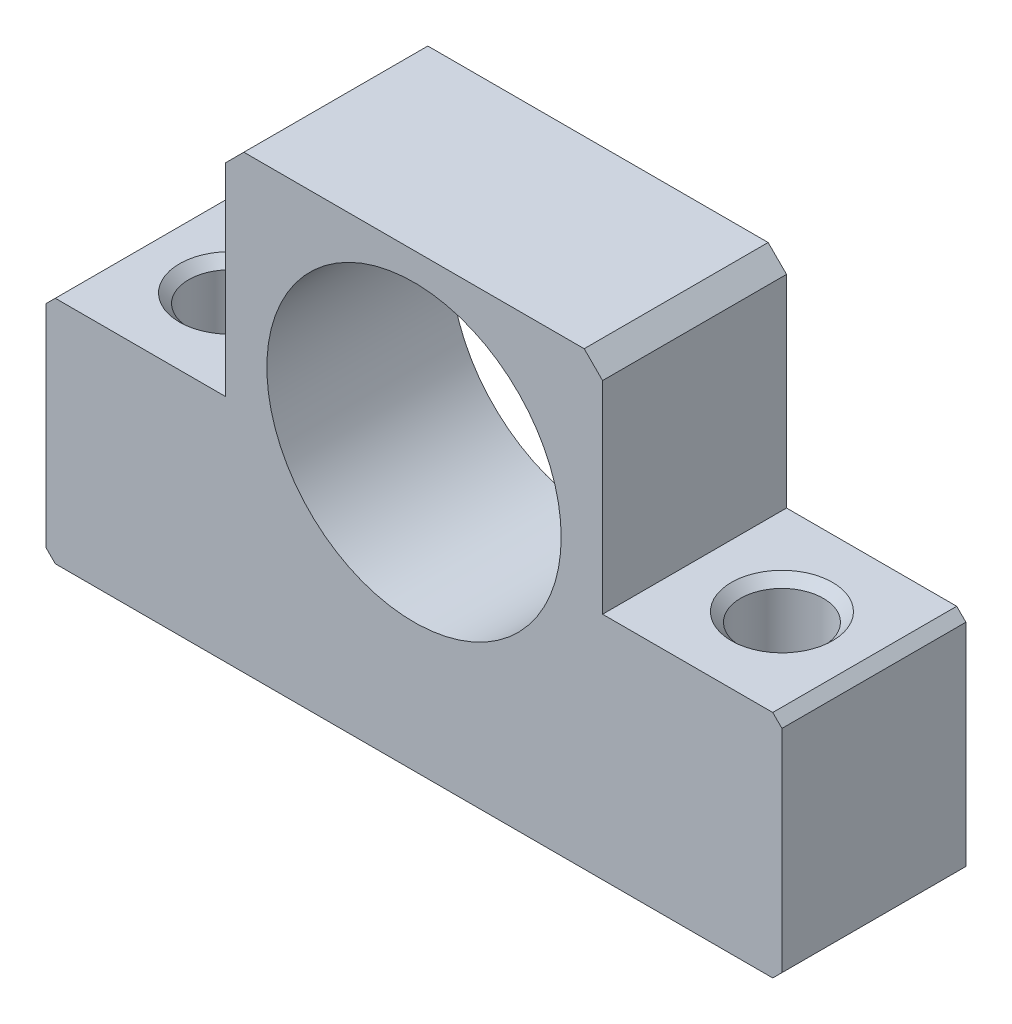
ISO-10303-21;
HEADER;
FILE_DESCRIPTION(('STEP AP214'),'2;1');
FILE_NAME('part.step','',(''),(''),'','','');
FILE_SCHEMA(('AUTOMOTIVE_DESIGN { 1 0 10303 214 1 1 1 1 }'));
ENDSEC;
DATA;
#1=APPLICATION_CONTEXT('core data for automotive mechanical design processes');
#2=APPLICATION_PROTOCOL_DEFINITION('international standard','automotive_design',2000,#1);
#3=PRODUCT_CONTEXT('',#1,'mechanical');
#4=PRODUCT('Part','Part','',(#3));
#5=PRODUCT_RELATED_PRODUCT_CATEGORY('part','',(#4));
#6=PRODUCT_DEFINITION_FORMATION('','',#4);
#7=PRODUCT_DEFINITION_CONTEXT('part definition',#1,'design');
#8=PRODUCT_DEFINITION('design','',#6,#7);
#9=PRODUCT_DEFINITION_SHAPE('','',#8);
#10=(LENGTH_UNIT() NAMED_UNIT(*) SI_UNIT(.MILLI.,.METRE.));
#11=(NAMED_UNIT(*) PLANE_ANGLE_UNIT() SI_UNIT($,.RADIAN.));
#12=(NAMED_UNIT(*) SI_UNIT($,.STERADIAN.) SOLID_ANGLE_UNIT());
#13=UNCERTAINTY_MEASURE_WITH_UNIT(LENGTH_MEASURE(1.E-05),#10,'distance_accuracy_value','');
#14=(GEOMETRIC_REPRESENTATION_CONTEXT(3) GLOBAL_UNCERTAINTY_ASSIGNED_CONTEXT((#13)) GLOBAL_UNIT_ASSIGNED_CONTEXT((#10,
#11,#12)) REPRESENTATION_CONTEXT('',''));
#15=CARTESIAN_POINT('',(0.,0.,0.));
#16=DIRECTION('',(0.,0.,1.));
#17=DIRECTION('',(1.,0.,0.));
#18=AXIS2_PLACEMENT_3D('',#15,#16,#17);
#19=CARTESIAN_POINT('',(-39.,-30.,-20.));
#20=DIRECTION('',(0.,-1.,0.));
#21=DIRECTION('',(0.,0.,-1.));
#22=AXIS2_PLACEMENT_3D('',#19,#20,#21);
#23=PLANE('',#22);
#24=CARTESIAN_POINT('',(30.,-30.,-10.));
#25=DIRECTION('',(0.,1.,0.));
#26=DIRECTION('',(0.,0.,1.));
#27=AXIS2_PLACEMENT_3D('',#24,#25,#26);
#28=CIRCLE('',#27,5.5);
#29=CARTESIAN_POINT('',(30.,-30.,-4.5));
#30=VERTEX_POINT('',#29);
#31=EDGE_CURVE('E471',#30,#30,#28,.T.);
#32=ORIENTED_EDGE('',*,*,#31,.T.);
#33=EDGE_LOOP('',(#32));
#34=FACE_BOUND('',#33,.T.);
#35=DIRECTION('',(1.,0.,0.));
#36=VECTOR('',#35,1.);
#37=CARTESIAN_POINT('',(-39.,-30.,0.));
#38=LINE('',#37,#36);
#39=CARTESIAN_POINT('',(-39.,-30.,0.));
#40=VERTEX_POINT('',#39);
#41=CARTESIAN_POINT('',(39.,-30.,0.));
#42=VERTEX_POINT('',#41);
#43=EDGE_CURVE('E176',#40,#42,#38,.T.);
#44=ORIENTED_EDGE('',*,*,#43,.F.);
#45=DIRECTION('',(0.,0.,1.));
#46=VECTOR('',#45,1.);
#47=CARTESIAN_POINT('',(-39.,-30.,-20.));
#48=LINE('',#47,#46);
#49=CARTESIAN_POINT('',(-39.,-30.,-20.));
#50=VERTEX_POINT('',#49);
#51=EDGE_CURVE('E227',#50,#40,#48,.T.);
#52=ORIENTED_EDGE('',*,*,#51,.F.);
#53=DIRECTION('',(1.,0.,0.));
#54=VECTOR('',#53,1.);
#55=CARTESIAN_POINT('',(-39.,-30.,-20.));
#56=LINE('',#55,#54);
#57=CARTESIAN_POINT('',(39.,-30.,-20.));
#58=VERTEX_POINT('',#57);
#59=EDGE_CURVE('E276',#50,#58,#56,.T.);
#60=ORIENTED_EDGE('',*,*,#59,.T.);
#61=DIRECTION('',(0.,0.,1.));
#62=VECTOR('',#61,1.);
#63=CARTESIAN_POINT('',(39.,-30.,-20.));
#64=LINE('',#63,#62);
#65=EDGE_CURVE('E226',#58,#42,#64,.T.);
#66=ORIENTED_EDGE('',*,*,#65,.T.);
#67=EDGE_LOOP('',(#44,#52,#60,#66));
#68=FACE_BOUND('',#67,.T.);
#69=CARTESIAN_POINT('',(-30.,-30.,-10.));
#70=DIRECTION('',(0.,1.,0.));
#71=DIRECTION('',(0.,0.,1.));
#72=AXIS2_PLACEMENT_3D('',#69,#70,#71);
#73=CIRCLE('',#72,5.5);
#74=CARTESIAN_POINT('',(-30.,-30.,-4.5));
#75=VERTEX_POINT('',#74);
#76=EDGE_CURVE('E461',#75,#75,#73,.T.);
#77=ORIENTED_EDGE('',*,*,#76,.T.);
#78=EDGE_LOOP('',(#77));
#79=FACE_BOUND('',#78,.T.);
#80=ADVANCED_FACE('F34',(#34,#68,#79),#23,.T.);
#81=CARTESIAN_POINT('',(-20.5,-5.,-20.));
#82=DIRECTION('',(0.,1.,0.));
#83=DIRECTION('',(0.,0.,1.));
#84=AXIS2_PLACEMENT_3D('',#81,#82,#83);
#85=PLANE('',#84);
#86=DIRECTION('',(-1.,0.,0.));
#87=VECTOR('',#86,1.);
#88=CARTESIAN_POINT('',(-20.5,-5.,0.));
#89=LINE('',#88,#87);
#90=CARTESIAN_POINT('',(-20.5,-5.,0.));
#91=VERTEX_POINT('',#90);
#92=CARTESIAN_POINT('',(-39.,-5.,0.));
#93=VERTEX_POINT('',#92);
#94=EDGE_CURVE('E146',#91,#93,#89,.T.);
#95=ORIENTED_EDGE('',*,*,#94,.F.);
#96=DIRECTION('',(0.,0.,1.));
#97=VECTOR('',#96,1.);
#98=CARTESIAN_POINT('',(-20.5,-5.,-20.));
#99=LINE('',#98,#97);
#100=CARTESIAN_POINT('',(-20.5,-5.,-20.));
#101=VERTEX_POINT('',#100);
#102=EDGE_CURVE('E140',#101,#91,#99,.T.);
#103=ORIENTED_EDGE('',*,*,#102,.F.);
#104=DIRECTION('',(-1.,0.,0.));
#105=VECTOR('',#104,1.);
#106=CARTESIAN_POINT('',(-20.5,-5.,-20.));
#107=LINE('',#106,#105);
#108=CARTESIAN_POINT('',(-39.,-5.,-20.));
#109=VERTEX_POINT('',#108);
#110=EDGE_CURVE('E144',#101,#109,#107,.T.);
#111=ORIENTED_EDGE('',*,*,#110,.T.);
#112=DIRECTION('',(0.,0.,1.));
#113=VECTOR('',#112,1.);
#114=CARTESIAN_POINT('',(-39.,-5.,-20.));
#115=LINE('',#114,#113);
#116=EDGE_CURVE('E44',#109,#93,#115,.T.);
#117=ORIENTED_EDGE('',*,*,#116,.T.);
#118=EDGE_LOOP('',(#95,#103,#111,#117));
#119=FACE_BOUND('',#118,.T.);
#120=CARTESIAN_POINT('',(-30.,-5.,-10.));
#121=DIRECTION('',(0.,1.,0.));
#122=DIRECTION('',(0.,0.,1.));
#123=AXIS2_PLACEMENT_3D('',#120,#121,#122);
#124=CIRCLE('',#123,5.5);
#125=CARTESIAN_POINT('',(-30.,-5.,-4.5));
#126=VERTEX_POINT('',#125);
#127=EDGE_CURVE('E468',#126,#126,#124,.T.);
#128=ORIENTED_EDGE('',*,*,#127,.F.);
#129=EDGE_LOOP('',(#128));
#130=FACE_BOUND('',#129,.T.);
#131=ADVANCED_FACE('F142',(#119,#130),#85,.T.);
#132=CARTESIAN_POINT('',(39.,-5.,-20.));
#133=DIRECTION('',(0.,1.,0.));
#134=DIRECTION('',(0.,0.,1.));
#135=AXIS2_PLACEMENT_3D('',#132,#133,#134);
#136=PLANE('',#135);
#137=DIRECTION('',(-1.,0.,0.));
#138=VECTOR('',#137,1.);
#139=CARTESIAN_POINT('',(39.,-5.,0.));
#140=LINE('',#139,#138);
#141=CARTESIAN_POINT('',(39.,-5.,0.));
#142=VERTEX_POINT('',#141);
#143=CARTESIAN_POINT('',(20.5,-5.,0.));
#144=VERTEX_POINT('',#143);
#145=EDGE_CURVE('E188',#142,#144,#140,.T.);
#146=ORIENTED_EDGE('',*,*,#145,.F.);
#147=DIRECTION('',(0.,0.,1.));
#148=VECTOR('',#147,1.);
#149=CARTESIAN_POINT('',(39.,-5.,-20.));
#150=LINE('',#149,#148);
#151=CARTESIAN_POINT('',(39.,-5.,-20.));
#152=VERTEX_POINT('',#151);
#153=EDGE_CURVE('E220',#152,#142,#150,.T.);
#154=ORIENTED_EDGE('',*,*,#153,.F.);
#155=DIRECTION('',(-1.,0.,0.));
#156=VECTOR('',#155,1.);
#157=CARTESIAN_POINT('',(39.,-5.,-20.));
#158=LINE('',#157,#156);
#159=CARTESIAN_POINT('',(20.5,-5.,-20.));
#160=VERTEX_POINT('',#159);
#161=EDGE_CURVE('E290',#152,#160,#158,.T.);
#162=ORIENTED_EDGE('',*,*,#161,.T.);
#163=DIRECTION('',(0.,0.,1.));
#164=VECTOR('',#163,1.);
#165=CARTESIAN_POINT('',(20.5,-5.,-20.));
#166=LINE('',#165,#164);
#167=EDGE_CURVE('E218',#160,#144,#166,.T.);
#168=ORIENTED_EDGE('',*,*,#167,.T.);
#169=EDGE_LOOP('',(#146,#154,#162,#168));
#170=FACE_BOUND('',#169,.T.);
#171=CARTESIAN_POINT('',(30.,-5.,-10.));
#172=DIRECTION('',(0.,1.,0.));
#173=DIRECTION('',(0.,0.,1.));
#174=AXIS2_PLACEMENT_3D('',#171,#172,#173);
#175=CIRCLE('',#174,5.5);
#176=CARTESIAN_POINT('',(30.,-5.,-4.5));
#177=VERTEX_POINT('',#176);
#178=EDGE_CURVE('E479',#177,#177,#175,.T.);
#179=ORIENTED_EDGE('',*,*,#178,.F.);
#180=EDGE_LOOP('',(#179));
#181=FACE_BOUND('',#180,.T.);
#182=ADVANCED_FACE('F241',(#170,#181),#136,.T.);
#183=CARTESIAN_POINT('',(-40.,-6.,-20.));
#184=DIRECTION('',(-1.,0.,0.));
#185=DIRECTION('',(0.,0.,1.));
#186=AXIS2_PLACEMENT_3D('',#183,#184,#185);
#187=PLANE('',#186);
#188=DIRECTION('',(0.,-1.,0.));
#189=VECTOR('',#188,1.);
#190=CARTESIAN_POINT('',(-40.,-6.,0.));
#191=LINE('',#190,#189);
#192=CARTESIAN_POINT('',(-40.,-6.,0.));
#193=VERTEX_POINT('',#192);
#194=CARTESIAN_POINT('',(-40.,-29.,0.));
#195=VERTEX_POINT('',#194);
#196=EDGE_CURVE('E169',#193,#195,#191,.T.);
#197=ORIENTED_EDGE('',*,*,#196,.F.);
#198=DIRECTION('',(0.,0.,1.));
#199=VECTOR('',#198,1.);
#200=CARTESIAN_POINT('',(-40.,-6.,-20.));
#201=LINE('',#200,#199);
#202=CARTESIAN_POINT('',(-40.,-6.,-20.));
#203=VERTEX_POINT('',#202);
#204=EDGE_CURVE('E11',#203,#193,#201,.T.);
#205=ORIENTED_EDGE('',*,*,#204,.F.);
#206=DIRECTION('',(0.,-1.,0.));
#207=VECTOR('',#206,1.);
#208=CARTESIAN_POINT('',(-40.,-6.,-20.));
#209=LINE('',#208,#207);
#210=CARTESIAN_POINT('',(-40.,-29.,-20.));
#211=VERTEX_POINT('',#210);
#212=EDGE_CURVE('E208',#203,#211,#209,.T.);
#213=ORIENTED_EDGE('',*,*,#212,.T.);
#214=DIRECTION('',(0.,0.,1.));
#215=VECTOR('',#214,1.);
#216=CARTESIAN_POINT('',(-40.,-29.,-20.));
#217=LINE('',#216,#215);
#218=EDGE_CURVE('E38',#211,#195,#217,.T.);
#219=ORIENTED_EDGE('',*,*,#218,.T.);
#220=EDGE_LOOP('',(#197,#205,#213,#219));
#221=FACE_BOUND('',#220,.T.);
#222=ADVANCED_FACE('F36',(#221),#187,.T.);
#223=CARTESIAN_POINT('',(-39.,-5.,-20.));
#224=DIRECTION('',(-0.707106781186547,0.707106781186548,0.));
#225=DIRECTION('',(-0.707106781186548,-0.707106781186547,0.));
#226=AXIS2_PLACEMENT_3D('',#223,#224,#225);
#227=PLANE('',#226);
#228=DIRECTION('',(-0.707106781186548,-0.707106781186547,0.));
#229=VECTOR('',#228,1.);
#230=CARTESIAN_POINT('',(-39.,-5.,0.));
#231=LINE('',#230,#229);
#232=EDGE_CURVE('E206',#93,#193,#231,.T.);
#233=ORIENTED_EDGE('',*,*,#232,.F.);
#234=ORIENTED_EDGE('',*,*,#116,.F.);
#235=DIRECTION('',(-0.707106781186548,-0.707106781186547,0.));
#236=VECTOR('',#235,1.);
#237=CARTESIAN_POINT('',(-39.,-5.,-20.));
#238=LINE('',#237,#236);
#239=EDGE_CURVE('E159',#109,#203,#238,.T.);
#240=ORIENTED_EDGE('',*,*,#239,.T.);
#241=ORIENTED_EDGE('',*,*,#204,.T.);
#242=EDGE_LOOP('',(#233,#234,#240,#241));
#243=FACE_BOUND('',#242,.T.);
#244=ADVANCED_FACE('F232',(#243),#227,.T.);
#245=CARTESIAN_POINT('',(-20.5,17.,-20.));
#246=DIRECTION('',(-1.,0.,0.));
#247=DIRECTION('',(0.,0.,1.));
#248=AXIS2_PLACEMENT_3D('',#245,#246,#247);
#249=PLANE('',#248);
#250=DIRECTION('',(0.,-1.,0.));
#251=VECTOR('',#250,1.);
#252=CARTESIAN_POINT('',(-20.5,17.,0.));
#253=LINE('',#252,#251);
#254=CARTESIAN_POINT('',(-20.5,17.,0.));
#255=VERTEX_POINT('',#254);
#256=EDGE_CURVE('E203',#255,#91,#253,.T.);
#257=ORIENTED_EDGE('',*,*,#256,.F.);
#258=DIRECTION('',(0.,0.,1.));
#259=VECTOR('',#258,1.);
#260=CARTESIAN_POINT('',(-20.5,17.,-20.));
#261=LINE('',#260,#259);
#262=CARTESIAN_POINT('',(-20.5,17.,-20.));
#263=VERTEX_POINT('',#262);
#264=EDGE_CURVE('E151',#263,#255,#261,.T.);
#265=ORIENTED_EDGE('',*,*,#264,.F.);
#266=DIRECTION('',(0.,-1.,0.));
#267=VECTOR('',#266,1.);
#268=CARTESIAN_POINT('',(-20.5,17.,-20.));
#269=LINE('',#268,#267);
#270=EDGE_CURVE('E157',#263,#101,#269,.T.);
#271=ORIENTED_EDGE('',*,*,#270,.T.);
#272=ORIENTED_EDGE('',*,*,#102,.T.);
#273=EDGE_LOOP('',(#257,#265,#271,#272));
#274=FACE_BOUND('',#273,.T.);
#275=ADVANCED_FACE('F161',(#274),#249,.T.);
#276=CARTESIAN_POINT('',(-18.5,19.,-20.));
#277=DIRECTION('',(-0.707106781186547,0.707106781186548,0.));
#278=DIRECTION('',(-0.707106781186548,-0.707106781186547,0.));
#279=AXIS2_PLACEMENT_3D('',#276,#277,#278);
#280=PLANE('',#279);
#281=DIRECTION('',(-0.707106781186548,-0.707106781186547,0.));
#282=VECTOR('',#281,1.);
#283=CARTESIAN_POINT('',(-18.5,19.,0.));
#284=LINE('',#283,#282);
#285=CARTESIAN_POINT('',(-18.5,19.,0.));
#286=VERTEX_POINT('',#285);
#287=EDGE_CURVE('E200',#286,#255,#284,.T.);
#288=ORIENTED_EDGE('',*,*,#287,.F.);
#289=DIRECTION('',(0.,0.,1.));
#290=VECTOR('',#289,1.);
#291=CARTESIAN_POINT('',(-18.5,19.,-20.));
#292=LINE('',#291,#290);
#293=CARTESIAN_POINT('',(-18.5,19.,-20.));
#294=VERTEX_POINT('',#293);
#295=EDGE_CURVE('E212',#294,#286,#292,.T.);
#296=ORIENTED_EDGE('',*,*,#295,.F.);
#297=DIRECTION('',(-0.707106781186548,-0.707106781186547,0.));
#298=VECTOR('',#297,1.);
#299=CARTESIAN_POINT('',(-18.5,19.,-20.));
#300=LINE('',#299,#298);
#301=EDGE_CURVE('E162',#294,#263,#300,.T.);
#302=ORIENTED_EDGE('',*,*,#301,.T.);
#303=ORIENTED_EDGE('',*,*,#264,.T.);
#304=EDGE_LOOP('',(#288,#296,#302,#303));
#305=FACE_BOUND('',#304,.T.);
#306=ADVANCED_FACE('F239',(#305),#280,.T.);
#307=CARTESIAN_POINT('',(18.5,19.,-20.));
#308=DIRECTION('',(0.,1.,0.));
#309=DIRECTION('',(0.,0.,1.));
#310=AXIS2_PLACEMENT_3D('',#307,#308,#309);
#311=PLANE('',#310);
#312=DIRECTION('',(-1.,0.,0.));
#313=VECTOR('',#312,1.);
#314=CARTESIAN_POINT('',(18.5,19.,0.));
#315=LINE('',#314,#313);
#316=CARTESIAN_POINT('',(18.5,19.,0.));
#317=VERTEX_POINT('',#316);
#318=EDGE_CURVE('E197',#317,#286,#315,.T.);
#319=ORIENTED_EDGE('',*,*,#318,.F.);
#320=DIRECTION('',(0.,0.,1.));
#321=VECTOR('',#320,1.);
#322=CARTESIAN_POINT('',(18.5,19.,-20.));
#323=LINE('',#322,#321);
#324=CARTESIAN_POINT('',(18.5,19.,-20.));
#325=VERTEX_POINT('',#324);
#326=EDGE_CURVE('E214',#325,#317,#323,.T.);
#327=ORIENTED_EDGE('',*,*,#326,.F.);
#328=DIRECTION('',(-1.,0.,0.));
#329=VECTOR('',#328,1.);
#330=CARTESIAN_POINT('',(18.5,19.,-20.));
#331=LINE('',#330,#329);
#332=EDGE_CURVE('E164',#325,#294,#331,.T.);
#333=ORIENTED_EDGE('',*,*,#332,.T.);
#334=ORIENTED_EDGE('',*,*,#295,.T.);
#335=EDGE_LOOP('',(#319,#327,#333,#334));
#336=FACE_BOUND('',#335,.T.);
#337=ADVANCED_FACE('F302',(#336),#311,.T.);
#338=CARTESIAN_POINT('',(20.5,17.,-20.));
#339=DIRECTION('',(0.707106781186547,0.707106781186548,0.));
#340=DIRECTION('',(-0.707106781186548,0.707106781186547,0.));
#341=AXIS2_PLACEMENT_3D('',#338,#339,#340);
#342=PLANE('',#341);
#343=DIRECTION('',(-0.707106781186548,0.707106781186547,0.));
#344=VECTOR('',#343,1.);
#345=CARTESIAN_POINT('',(20.5,17.,0.));
#346=LINE('',#345,#344);
#347=CARTESIAN_POINT('',(20.5,17.,0.));
#348=VERTEX_POINT('',#347);
#349=EDGE_CURVE('E194',#348,#317,#346,.T.);
#350=ORIENTED_EDGE('',*,*,#349,.F.);
#351=DIRECTION('',(0.,0.,1.));
#352=VECTOR('',#351,1.);
#353=CARTESIAN_POINT('',(20.5,17.,-20.));
#354=LINE('',#353,#352);
#355=CARTESIAN_POINT('',(20.5,17.,-20.));
#356=VERTEX_POINT('',#355);
#357=EDGE_CURVE('E216',#356,#348,#354,.T.);
#358=ORIENTED_EDGE('',*,*,#357,.F.);
#359=DIRECTION('',(-0.707106781186548,0.707106781186547,0.));
#360=VECTOR('',#359,1.);
#361=CARTESIAN_POINT('',(20.5,17.,-20.));
#362=LINE('',#361,#360);
#363=EDGE_CURVE('E296',#356,#325,#362,.T.);
#364=ORIENTED_EDGE('',*,*,#363,.T.);
#365=ORIENTED_EDGE('',*,*,#326,.T.);
#366=EDGE_LOOP('',(#350,#358,#364,#365));
#367=FACE_BOUND('',#366,.T.);
#368=ADVANCED_FACE('F308',(#367),#342,.T.);
#369=CARTESIAN_POINT('',(20.5,-5.,-20.));
#370=DIRECTION('',(1.,0.,0.));
#371=DIRECTION('',(0.,0.,-1.));
#372=AXIS2_PLACEMENT_3D('',#369,#370,#371);
#373=PLANE('',#372);
#374=DIRECTION('',(0.,1.,0.));
#375=VECTOR('',#374,1.);
#376=CARTESIAN_POINT('',(20.5,-5.,0.));
#377=LINE('',#376,#375);
#378=EDGE_CURVE('E191',#144,#348,#377,.T.);
#379=ORIENTED_EDGE('',*,*,#378,.F.);
#380=ORIENTED_EDGE('',*,*,#167,.F.);
#381=DIRECTION('',(0.,1.,0.));
#382=VECTOR('',#381,1.);
#383=CARTESIAN_POINT('',(20.5,-5.,-20.));
#384=LINE('',#383,#382);
#385=EDGE_CURVE('E293',#160,#356,#384,.T.);
#386=ORIENTED_EDGE('',*,*,#385,.T.);
#387=ORIENTED_EDGE('',*,*,#357,.T.);
#388=EDGE_LOOP('',(#379,#380,#386,#387));
#389=FACE_BOUND('',#388,.T.);
#390=ADVANCED_FACE('F311',(#389),#373,.T.);
#391=CARTESIAN_POINT('',(40.,-6.,-20.));
#392=DIRECTION('',(0.707106781186547,0.707106781186548,0.));
#393=DIRECTION('',(-0.707106781186548,0.707106781186547,0.));
#394=AXIS2_PLACEMENT_3D('',#391,#392,#393);
#395=PLANE('',#394);
#396=DIRECTION('',(-0.707106781186548,0.707106781186547,0.));
#397=VECTOR('',#396,1.);
#398=CARTESIAN_POINT('',(40.,-6.,0.));
#399=LINE('',#398,#397);
#400=CARTESIAN_POINT('',(40.,-6.,0.));
#401=VERTEX_POINT('',#400);
#402=EDGE_CURVE('E185',#401,#142,#399,.T.);
#403=ORIENTED_EDGE('',*,*,#402,.F.);
#404=DIRECTION('',(0.,0.,1.));
#405=VECTOR('',#404,1.);
#406=CARTESIAN_POINT('',(40.,-6.,-20.));
#407=LINE('',#406,#405);
#408=CARTESIAN_POINT('',(40.,-6.,-20.));
#409=VERTEX_POINT('',#408);
#410=EDGE_CURVE('E222',#409,#401,#407,.T.);
#411=ORIENTED_EDGE('',*,*,#410,.F.);
#412=DIRECTION('',(-0.707106781186548,0.707106781186547,0.));
#413=VECTOR('',#412,1.);
#414=CARTESIAN_POINT('',(40.,-6.,-20.));
#415=LINE('',#414,#413);
#416=EDGE_CURVE('E287',#409,#152,#415,.T.);
#417=ORIENTED_EDGE('',*,*,#416,.T.);
#418=ORIENTED_EDGE('',*,*,#153,.T.);
#419=EDGE_LOOP('',(#403,#411,#417,#418));
#420=FACE_BOUND('',#419,.T.);
#421=ADVANCED_FACE('F267',(#420),#395,.T.);
#422=CARTESIAN_POINT('',(40.,-29.,-20.));
#423=DIRECTION('',(1.,0.,0.));
#424=DIRECTION('',(0.,0.,-1.));
#425=AXIS2_PLACEMENT_3D('',#422,#423,#424);
#426=PLANE('',#425);
#427=DIRECTION('',(0.,1.,0.));
#428=VECTOR('',#427,1.);
#429=CARTESIAN_POINT('',(40.,-29.,0.));
#430=LINE('',#429,#428);
#431=CARTESIAN_POINT('',(40.,-29.,0.));
#432=VERTEX_POINT('',#431);
#433=EDGE_CURVE('E182',#432,#401,#430,.T.);
#434=ORIENTED_EDGE('',*,*,#433,.F.);
#435=DIRECTION('',(0.,0.,1.));
#436=VECTOR('',#435,1.);
#437=CARTESIAN_POINT('',(40.,-29.,-20.));
#438=LINE('',#437,#436);
#439=CARTESIAN_POINT('',(40.,-29.,-20.));
#440=VERTEX_POINT('',#439);
#441=EDGE_CURVE('E224',#440,#432,#438,.T.);
#442=ORIENTED_EDGE('',*,*,#441,.F.);
#443=DIRECTION('',(0.,1.,0.));
#444=VECTOR('',#443,1.);
#445=CARTESIAN_POINT('',(40.,-29.,-20.));
#446=LINE('',#445,#444);
#447=EDGE_CURVE('E280',#440,#409,#446,.T.);
#448=ORIENTED_EDGE('',*,*,#447,.T.);
#449=ORIENTED_EDGE('',*,*,#410,.T.);
#450=EDGE_LOOP('',(#434,#442,#448,#449));
#451=FACE_BOUND('',#450,.T.);
#452=ADVANCED_FACE('F262',(#451),#426,.T.);
#453=CARTESIAN_POINT('',(39.,-30.,-20.));
#454=DIRECTION('',(0.707106781186546,-0.707106781186549,0.));
#455=DIRECTION('',(0.707106781186549,0.707106781186546,0.));
#456=AXIS2_PLACEMENT_3D('',#453,#454,#455);
#457=PLANE('',#456);
#458=DIRECTION('',(0.707106781186549,0.707106781186546,0.));
#459=VECTOR('',#458,1.);
#460=CARTESIAN_POINT('',(39.,-30.,0.));
#461=LINE('',#460,#459);
#462=EDGE_CURVE('E179',#42,#432,#461,.T.);
#463=ORIENTED_EDGE('',*,*,#462,.F.);
#464=ORIENTED_EDGE('',*,*,#65,.F.);
#465=DIRECTION('',(0.707106781186549,0.707106781186546,0.));
#466=VECTOR('',#465,1.);
#467=CARTESIAN_POINT('',(39.,-30.,-20.));
#468=LINE('',#467,#466);
#469=EDGE_CURVE('E277',#58,#440,#468,.T.);
#470=ORIENTED_EDGE('',*,*,#469,.T.);
#471=ORIENTED_EDGE('',*,*,#441,.T.);
#472=EDGE_LOOP('',(#463,#464,#470,#471));
#473=FACE_BOUND('',#472,.T.);
#474=ADVANCED_FACE('F253',(#473),#457,.T.);
#475=CARTESIAN_POINT('',(-40.,-29.,-20.));
#476=DIRECTION('',(-0.707106781186546,-0.707106781186549,0.));
#477=DIRECTION('',(0.707106781186549,-0.707106781186546,0.));
#478=AXIS2_PLACEMENT_3D('',#475,#476,#477);
#479=PLANE('',#478);
#480=DIRECTION('',(0.707106781186549,-0.707106781186546,0.));
#481=VECTOR('',#480,1.);
#482=CARTESIAN_POINT('',(-40.,-29.,0.));
#483=LINE('',#482,#481);
#484=EDGE_CURVE('E172',#195,#40,#483,.T.);
#485=ORIENTED_EDGE('',*,*,#484,.F.);
#486=ORIENTED_EDGE('',*,*,#218,.F.);
#487=DIRECTION('',(0.707106781186549,-0.707106781186546,0.));
#488=VECTOR('',#487,1.);
#489=CARTESIAN_POINT('',(-40.,-29.,-20.));
#490=LINE('',#489,#488);
#491=EDGE_CURVE('E278',#211,#50,#490,.T.);
#492=ORIENTED_EDGE('',*,*,#491,.T.);
#493=ORIENTED_EDGE('',*,*,#51,.T.);
#494=EDGE_LOOP('',(#485,#486,#492,#493));
#495=FACE_BOUND('',#494,.T.);
#496=ADVANCED_FACE('F229',(#495),#479,.T.);
#497=CARTESIAN_POINT('',(0.,0.,-20.));
#498=DIRECTION('',(0.,0.,1.));
#499=DIRECTION('',(1.,0.,0.));
#500=AXIS2_PLACEMENT_3D('',#497,#498,#499);
#501=PLANE('',#500);
#502=CARTESIAN_POINT('',(0.,0.,-20.));
#503=DIRECTION('',(0.,0.,1.));
#504=DIRECTION('',(1.,0.,0.));
#505=AXIS2_PLACEMENT_3D('',#502,#503,#504);
#506=CIRCLE('',#505,16.);
#507=CARTESIAN_POINT('',(16.,0.,-20.));
#508=VERTEX_POINT('',#507);
#509=EDGE_CURVE('E173',#508,#508,#506,.T.);
#510=ORIENTED_EDGE('',*,*,#509,.T.);
#511=EDGE_LOOP('',(#510));
#512=FACE_BOUND('',#511,.T.);
#513=ORIENTED_EDGE('',*,*,#212,.F.);
#514=ORIENTED_EDGE('',*,*,#239,.F.);
#515=ORIENTED_EDGE('',*,*,#110,.F.);
#516=ORIENTED_EDGE('',*,*,#270,.F.);
#517=ORIENTED_EDGE('',*,*,#301,.F.);
#518=ORIENTED_EDGE('',*,*,#332,.F.);
#519=ORIENTED_EDGE('',*,*,#363,.F.);
#520=ORIENTED_EDGE('',*,*,#385,.F.);
#521=ORIENTED_EDGE('',*,*,#161,.F.);
#522=ORIENTED_EDGE('',*,*,#416,.F.);
#523=ORIENTED_EDGE('',*,*,#447,.F.);
#524=ORIENTED_EDGE('',*,*,#469,.F.);
#525=ORIENTED_EDGE('',*,*,#59,.F.);
#526=ORIENTED_EDGE('',*,*,#491,.F.);
#527=EDGE_LOOP('',(#513,#514,#515,#516,#517,#518,#519,#520,#521,#522,#523,#524,#525,#526));
#528=FACE_BOUND('',#527,.T.);
#529=ADVANCED_FACE('F155',(#512,#528),#501,.F.);
#530=CARTESIAN_POINT('',(0.,0.,0.));
#531=DIRECTION('',(0.,0.,1.));
#532=DIRECTION('',(1.,0.,0.));
#533=AXIS2_PLACEMENT_3D('',#530,#531,#532);
#534=PLANE('',#533);
#535=CARTESIAN_POINT('',(0.,0.,0.));
#536=DIRECTION('',(0.,0.,1.));
#537=DIRECTION('',(1.,0.,0.));
#538=AXIS2_PLACEMENT_3D('',#535,#536,#537);
#539=CIRCLE('',#538,16.);
#540=CARTESIAN_POINT('',(16.,0.,0.));
#541=VERTEX_POINT('',#540);
#542=EDGE_CURVE('E482',#541,#541,#539,.T.);
#543=ORIENTED_EDGE('',*,*,#542,.F.);
#544=EDGE_LOOP('',(#543));
#545=FACE_BOUND('',#544,.T.);
#546=ORIENTED_EDGE('',*,*,#196,.T.);
#547=ORIENTED_EDGE('',*,*,#484,.T.);
#548=ORIENTED_EDGE('',*,*,#43,.T.);
#549=ORIENTED_EDGE('',*,*,#462,.T.);
#550=ORIENTED_EDGE('',*,*,#433,.T.);
#551=ORIENTED_EDGE('',*,*,#402,.T.);
#552=ORIENTED_EDGE('',*,*,#145,.T.);
#553=ORIENTED_EDGE('',*,*,#378,.T.);
#554=ORIENTED_EDGE('',*,*,#349,.T.);
#555=ORIENTED_EDGE('',*,*,#318,.T.);
#556=ORIENTED_EDGE('',*,*,#287,.T.);
#557=ORIENTED_EDGE('',*,*,#256,.T.);
#558=ORIENTED_EDGE('',*,*,#94,.T.);
#559=ORIENTED_EDGE('',*,*,#232,.T.);
#560=EDGE_LOOP('',(#546,#547,#548,#549,#550,#551,#552,#553,#554,#555,#556,#557,#558,#559));
#561=FACE_BOUND('',#560,.T.);
#562=ADVANCED_FACE('F231',(#545,#561),#534,.T.);
#563=CARTESIAN_POINT('',(0.,0.,-20.));
#564=DIRECTION('',(0.,0.,1.));
#565=DIRECTION('',(1.,0.,0.));
#566=AXIS2_PLACEMENT_3D('',#563,#564,#565);
#567=CYLINDRICAL_SURFACE('',#566,16.);
#568=ORIENTED_EDGE('',*,*,#509,.F.);
#569=EDGE_LOOP('',(#568));
#570=FACE_BOUND('',#569,.T.);
#571=ORIENTED_EDGE('',*,*,#542,.T.);
#572=EDGE_LOOP('',(#571));
#573=FACE_BOUND('',#572,.T.);
#574=ADVANCED_FACE('F366',(#570,#573),#567,.F.);
#575=CARTESIAN_POINT('',(30.,-6.,-10.));
#576=DIRECTION('',(0.,1.,0.));
#577=DIRECTION('',(0.,0.,1.));
#578=AXIS2_PLACEMENT_3D('',#575,#576,#577);
#579=CONICAL_SURFACE('',#578,4.5,0.785398163397447);
#580=ORIENTED_EDGE('',*,*,#178,.T.);
#581=EDGE_LOOP('',(#580));
#582=FACE_BOUND('',#581,.T.);
#583=CARTESIAN_POINT('',(30.,-6.,-10.));
#584=DIRECTION('',(0.,1.,0.));
#585=DIRECTION('',(0.,0.,1.));
#586=AXIS2_PLACEMENT_3D('',#583,#584,#585);
#587=CIRCLE('',#586,4.5);
#588=CARTESIAN_POINT('',(30.,-6.,-5.5));
#589=VERTEX_POINT('',#588);
#590=EDGE_CURVE('E476',#589,#589,#587,.T.);
#591=ORIENTED_EDGE('',*,*,#590,.F.);
#592=EDGE_LOOP('',(#591));
#593=FACE_BOUND('',#592,.T.);
#594=ADVANCED_FACE('F375',(#582,#593),#579,.F.);
#595=CARTESIAN_POINT('',(30.,-30.,-10.));
#596=DIRECTION('',(0.,1.,0.));
#597=DIRECTION('',(0.,0.,1.));
#598=AXIS2_PLACEMENT_3D('',#595,#596,#597);
#599=CYLINDRICAL_SURFACE('',#598,4.5);
#600=ORIENTED_EDGE('',*,*,#590,.T.);
#601=EDGE_LOOP('',(#600));
#602=FACE_BOUND('',#601,.T.);
#603=CARTESIAN_POINT('',(30.,-29.,-10.));
#604=DIRECTION('',(0.,1.,0.));
#605=DIRECTION('',(0.,0.,1.));
#606=AXIS2_PLACEMENT_3D('',#603,#604,#605);
#607=CIRCLE('',#606,4.5);
#608=CARTESIAN_POINT('',(30.,-29.,-5.5));
#609=VERTEX_POINT('',#608);
#610=EDGE_CURVE('E473',#609,#609,#607,.T.);
#611=ORIENTED_EDGE('',*,*,#610,.F.);
#612=EDGE_LOOP('',(#611));
#613=FACE_BOUND('',#612,.T.);
#614=ADVANCED_FACE('F391',(#602,#613),#599,.F.);
#615=CARTESIAN_POINT('',(30.,-30.,-10.));
#616=DIRECTION('',(0.,-1.,0.));
#617=DIRECTION('',(0.,0.,-1.));
#618=AXIS2_PLACEMENT_3D('',#615,#616,#617);
#619=CONICAL_SURFACE('',#618,5.5,0.785398163397447);
#620=ORIENTED_EDGE('',*,*,#610,.T.);
#621=EDGE_LOOP('',(#620));
#622=FACE_BOUND('',#621,.T.);
#623=ORIENTED_EDGE('',*,*,#31,.F.);
#624=EDGE_LOOP('',(#623));
#625=FACE_BOUND('',#624,.T.);
#626=ADVANCED_FACE('F401',(#622,#625),#619,.F.);
#627=CARTESIAN_POINT('',(-30.,-6.,-10.));
#628=DIRECTION('',(0.,1.,0.));
#629=DIRECTION('',(0.,0.,1.));
#630=AXIS2_PLACEMENT_3D('',#627,#628,#629);
#631=CONICAL_SURFACE('',#630,4.5,0.785398163397448);
#632=ORIENTED_EDGE('',*,*,#127,.T.);
#633=EDGE_LOOP('',(#632));
#634=FACE_BOUND('',#633,.T.);
#635=CARTESIAN_POINT('',(-30.,-6.,-10.));
#636=DIRECTION('',(0.,1.,0.));
#637=DIRECTION('',(0.,0.,1.));
#638=AXIS2_PLACEMENT_3D('',#635,#636,#637);
#639=CIRCLE('',#638,4.5);
#640=CARTESIAN_POINT('',(-30.,-6.,-5.5));
#641=VERTEX_POINT('',#640);
#642=EDGE_CURVE('E463',#641,#641,#639,.T.);
#643=ORIENTED_EDGE('',*,*,#642,.F.);
#644=EDGE_LOOP('',(#643));
#645=FACE_BOUND('',#644,.T.);
#646=ADVANCED_FACE('F410',(#634,#645),#631,.F.);
#647=CARTESIAN_POINT('',(-30.,-30.,-10.));
#648=DIRECTION('',(0.,1.,0.));
#649=DIRECTION('',(0.,0.,1.));
#650=AXIS2_PLACEMENT_3D('',#647,#648,#649);
#651=CYLINDRICAL_SURFACE('',#650,4.5);
#652=ORIENTED_EDGE('',*,*,#642,.T.);
#653=EDGE_LOOP('',(#652));
#654=FACE_BOUND('',#653,.T.);
#655=CARTESIAN_POINT('',(-30.,-29.,-10.));
#656=DIRECTION('',(0.,1.,0.));
#657=DIRECTION('',(0.,0.,1.));
#658=AXIS2_PLACEMENT_3D('',#655,#656,#657);
#659=CIRCLE('',#658,4.5);
#660=CARTESIAN_POINT('',(-30.,-29.,-5.5));
#661=VERTEX_POINT('',#660);
#662=EDGE_CURVE('E458',#661,#661,#659,.T.);
#663=ORIENTED_EDGE('',*,*,#662,.F.);
#664=EDGE_LOOP('',(#663));
#665=FACE_BOUND('',#664,.T.);
#666=ADVANCED_FACE('F431',(#654,#665),#651,.F.);
#667=CARTESIAN_POINT('',(-30.,-30.,-10.));
#668=DIRECTION('',(0.,-1.,0.));
#669=DIRECTION('',(0.,0.,-1.));
#670=AXIS2_PLACEMENT_3D('',#667,#668,#669);
#671=CONICAL_SURFACE('',#670,5.5,0.785398163397448);
#672=ORIENTED_EDGE('',*,*,#662,.T.);
#673=EDGE_LOOP('',(#672));
#674=FACE_BOUND('',#673,.T.);
#675=ORIENTED_EDGE('',*,*,#76,.F.);
#676=EDGE_LOOP('',(#675));
#677=FACE_BOUND('',#676,.T.);
#678=ADVANCED_FACE('F441',(#674,#677),#671,.F.);
#679=CLOSED_SHELL('',(#80,#131,#182,#222,#244,#275,#306,#337,#368,#390,#421,#452,#474,#496,#529,
#562,#574,#594,#614,#626,#646,#666,#678));
#680=MANIFOLD_SOLID_BREP('B2',#679);
#681=ADVANCED_BREP_SHAPE_REPRESENTATION('',(#18,#680),#14);
#682=SHAPE_DEFINITION_REPRESENTATION(#9,#681);
ENDSEC;
END-ISO-10303-21;
